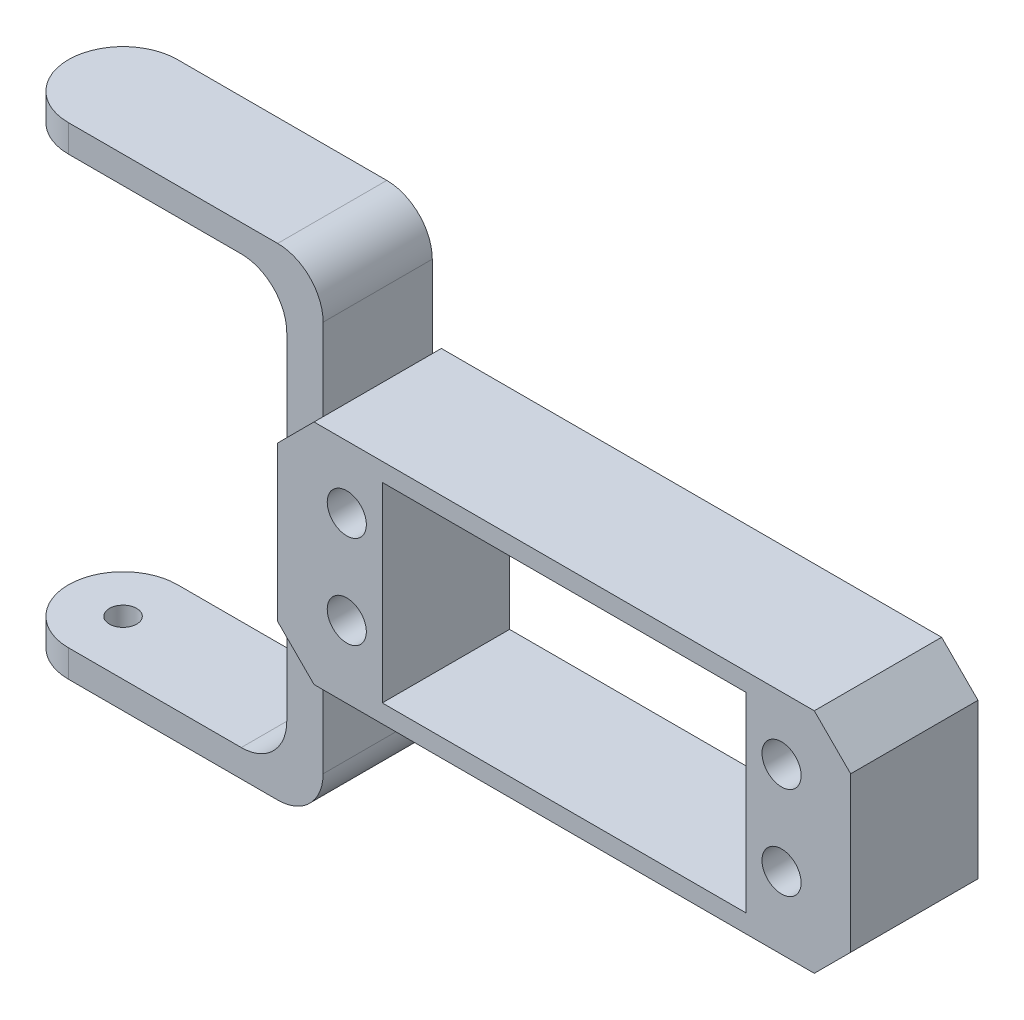
ISO-10303-21;
HEADER;
FILE_DESCRIPTION(('STEP AP214'),'2;1');
FILE_NAME('part.step','',(''),(''),'','','');
FILE_SCHEMA(('AUTOMOTIVE_DESIGN { 1 0 10303 214 1 1 1 1 }'));
ENDSEC;
DATA;
#1=APPLICATION_CONTEXT('core data for automotive mechanical design processes');
#2=APPLICATION_PROTOCOL_DEFINITION('international standard','automotive_design',2000,#1);
#3=PRODUCT_CONTEXT('',#1,'mechanical');
#4=PRODUCT('Part','Part','',(#3));
#5=PRODUCT_RELATED_PRODUCT_CATEGORY('part','',(#4));
#6=PRODUCT_DEFINITION_FORMATION('','',#4);
#7=PRODUCT_DEFINITION_CONTEXT('part definition',#1,'design');
#8=PRODUCT_DEFINITION('design','',#6,#7);
#9=PRODUCT_DEFINITION_SHAPE('','',#8);
#10=(LENGTH_UNIT() NAMED_UNIT(*) SI_UNIT(.MILLI.,.METRE.));
#11=(NAMED_UNIT(*) PLANE_ANGLE_UNIT() SI_UNIT($,.RADIAN.));
#12=(NAMED_UNIT(*) SI_UNIT($,.STERADIAN.) SOLID_ANGLE_UNIT());
#13=UNCERTAINTY_MEASURE_WITH_UNIT(LENGTH_MEASURE(1.E-05),#10,'distance_accuracy_value','');
#14=(GEOMETRIC_REPRESENTATION_CONTEXT(3) GLOBAL_UNCERTAINTY_ASSIGNED_CONTEXT((#13)) GLOBAL_UNIT_ASSIGNED_CONTEXT((#10,
#11,#12)) REPRESENTATION_CONTEXT('',''));
#15=CARTESIAN_POINT('',(0.,0.,0.));
#16=DIRECTION('',(0.,0.,1.));
#17=DIRECTION('',(1.,0.,0.));
#18=AXIS2_PLACEMENT_3D('',#15,#16,#17);
#19=CARTESIAN_POINT('',(-55.5,-26.5,7.));
#20=DIRECTION('',(0.,-1.,0.));
#21=DIRECTION('',(0.,0.,-1.));
#22=AXIS2_PLACEMENT_3D('',#19,#20,#21);
#23=CYLINDRICAL_SURFACE('',#22,6.);
#24=DIRECTION('',(0.,-1.,0.));
#25=VECTOR('',#24,1.);
#26=CARTESIAN_POINT('',(-55.5,-8.48032754033172,1.00000000000001));
#27=LINE('',#26,#25);
#28=CARTESIAN_POINT('',(-55.5,-26.5,1.));
#29=VERTEX_POINT('',#28);
#30=CARTESIAN_POINT('',(-55.5,-23.5,1.));
#31=VERTEX_POINT('',#30);
#32=EDGE_CURVE('E327',#29,#31,#27,.F.);
#33=ORIENTED_EDGE('',*,*,#32,.F.);
#34=CARTESIAN_POINT('',(-55.5,-26.5,7.));
#35=DIRECTION('',(0.,-1.,0.));
#36=DIRECTION('',(0.,0.,-1.));
#37=AXIS2_PLACEMENT_3D('',#34,#35,#36);
#38=CIRCLE('',#37,6.);
#39=CARTESIAN_POINT('',(-55.5,-26.5,13.));
#40=VERTEX_POINT('',#39);
#41=EDGE_CURVE('E47',#40,#29,#38,.T.);
#42=ORIENTED_EDGE('',*,*,#41,.F.);
#43=DIRECTION('',(0.,-1.,0.));
#44=VECTOR('',#43,1.);
#45=CARTESIAN_POINT('',(-55.5,-8.49999999999999,13.));
#46=LINE('',#45,#44);
#47=CARTESIAN_POINT('',(-55.5,-23.5,13.));
#48=VERTEX_POINT('',#47);
#49=EDGE_CURVE('E330',#48,#40,#46,.T.);
#50=ORIENTED_EDGE('',*,*,#49,.F.);
#51=CARTESIAN_POINT('',(-55.5,-23.5,7.));
#52=DIRECTION('',(0.,-1.,0.));
#53=DIRECTION('',(0.,0.,-1.));
#54=AXIS2_PLACEMENT_3D('',#51,#52,#53);
#55=CIRCLE('',#54,6.);
#56=EDGE_CURVE('E11',#31,#48,#55,.F.);
#57=ORIENTED_EDGE('',*,*,#56,.F.);
#58=EDGE_LOOP('',(#33,#42,#50,#57));
#59=FACE_BOUND('',#58,.T.);
#60=ADVANCED_FACE('F39',(#59),#23,.T.);
#61=CARTESIAN_POINT('',(-55.5,23.5,7.));
#62=DIRECTION('',(0.,-1.,0.));
#63=DIRECTION('',(0.,0.,-1.));
#64=AXIS2_PLACEMENT_3D('',#61,#62,#63);
#65=CYLINDRICAL_SURFACE('',#64,5.99999999999999);
#66=DIRECTION('',(0.,-1.,0.));
#67=VECTOR('',#66,1.);
#68=CARTESIAN_POINT('',(-55.5,26.5,1.00000000000001));
#69=LINE('',#68,#67);
#70=CARTESIAN_POINT('',(-55.5,23.5,1.00000000000001));
#71=VERTEX_POINT('',#70);
#72=CARTESIAN_POINT('',(-55.5,26.5,1.00000000000001));
#73=VERTEX_POINT('',#72);
#74=EDGE_CURVE('E317',#71,#73,#69,.F.);
#75=ORIENTED_EDGE('',*,*,#74,.F.);
#76=CARTESIAN_POINT('',(-55.5,23.5,7.));
#77=DIRECTION('',(0.,1.,0.));
#78=DIRECTION('',(0.,0.,1.));
#79=AXIS2_PLACEMENT_3D('',#76,#77,#78);
#80=CIRCLE('',#79,5.99999999999999);
#81=CARTESIAN_POINT('',(-55.5,23.5,13.));
#82=VERTEX_POINT('',#81);
#83=EDGE_CURVE('E323',#82,#71,#80,.F.);
#84=ORIENTED_EDGE('',*,*,#83,.F.);
#85=DIRECTION('',(0.,-1.,0.));
#86=VECTOR('',#85,1.);
#87=CARTESIAN_POINT('',(-55.5,26.5,13.));
#88=LINE('',#87,#86);
#89=CARTESIAN_POINT('',(-55.5,26.5,13.));
#90=VERTEX_POINT('',#89);
#91=EDGE_CURVE('E320',#90,#82,#88,.T.);
#92=ORIENTED_EDGE('',*,*,#91,.F.);
#93=CARTESIAN_POINT('',(-55.5,26.5,7.));
#94=DIRECTION('',(0.,1.,0.));
#95=DIRECTION('',(0.,0.,1.));
#96=AXIS2_PLACEMENT_3D('',#93,#94,#95);
#97=CIRCLE('',#96,5.99999999999999);
#98=EDGE_CURVE('E325',#73,#90,#97,.T.);
#99=ORIENTED_EDGE('',*,*,#98,.F.);
#100=EDGE_LOOP('',(#75,#84,#92,#99));
#101=FACE_BOUND('',#100,.T.);
#102=ADVANCED_FACE('F527',(#101),#65,.T.);
#103=CARTESIAN_POINT('',(-32.5,-21.5,0.));
#104=DIRECTION('',(0.,0.,1.));
#105=DIRECTION('',(1.,0.,0.));
#106=AXIS2_PLACEMENT_3D('',#103,#104,#105);
#107=CYLINDRICAL_SURFACE('',#106,5.);
#108=DIRECTION('',(0.,0.,-1.));
#109=VECTOR('',#108,1.);
#110=CARTESIAN_POINT('',(-27.5,-21.5,0.));
#111=LINE('',#110,#109);
#112=CARTESIAN_POINT('',(-27.5,-21.5,13.));
#113=VERTEX_POINT('',#112);
#114=CARTESIAN_POINT('',(-27.5,-21.5,1.));
#115=VERTEX_POINT('',#114);
#116=EDGE_CURVE('E307',#113,#115,#111,.T.);
#117=ORIENTED_EDGE('',*,*,#116,.F.);
#118=CARTESIAN_POINT('',(-32.5,-21.5,13.));
#119=DIRECTION('',(0.,0.,1.));
#120=DIRECTION('',(0.,-1.,0.));
#121=AXIS2_PLACEMENT_3D('',#118,#119,#120);
#122=CIRCLE('',#121,5.);
#123=CARTESIAN_POINT('',(-32.5,-26.5,13.));
#124=VERTEX_POINT('',#123);
#125=EDGE_CURVE('E313',#124,#113,#122,.T.);
#126=ORIENTED_EDGE('',*,*,#125,.F.);
#127=DIRECTION('',(0.,0.,-1.));
#128=VECTOR('',#127,1.);
#129=CARTESIAN_POINT('',(-32.5,-26.5,0.));
#130=LINE('',#129,#128);
#131=CARTESIAN_POINT('',(-32.5,-26.5,1.));
#132=VERTEX_POINT('',#131);
#133=EDGE_CURVE('E310',#132,#124,#130,.F.);
#134=ORIENTED_EDGE('',*,*,#133,.F.);
#135=CARTESIAN_POINT('',(-32.5,-21.5,1.));
#136=DIRECTION('',(0.,0.,-1.));
#137=DIRECTION('',(0.,1.,0.));
#138=AXIS2_PLACEMENT_3D('',#135,#136,#137);
#139=CIRCLE('',#138,5.);
#140=EDGE_CURVE('E315',#115,#132,#139,.T.);
#141=ORIENTED_EDGE('',*,*,#140,.F.);
#142=EDGE_LOOP('',(#117,#126,#134,#141));
#143=FACE_BOUND('',#142,.T.);
#144=ADVANCED_FACE('F565',(#143),#107,.T.);
#145=CARTESIAN_POINT('',(-36.5,-18.5,14.));
#146=DIRECTION('',(0.,0.,-1.));
#147=DIRECTION('',(0.,1.,0.));
#148=AXIS2_PLACEMENT_3D('',#145,#146,#147);
#149=CYLINDRICAL_SURFACE('',#148,5.);
#150=DIRECTION('',(0.,0.,1.));
#151=VECTOR('',#150,1.);
#152=CARTESIAN_POINT('',(-31.5,-18.5,14.));
#153=LINE('',#152,#151);
#154=CARTESIAN_POINT('',(-31.5,-18.5,1.));
#155=VERTEX_POINT('',#154);
#156=CARTESIAN_POINT('',(-31.5,-18.5,13.));
#157=VERTEX_POINT('',#156);
#158=EDGE_CURVE('E231',#155,#157,#153,.T.);
#159=ORIENTED_EDGE('',*,*,#158,.F.);
#160=CARTESIAN_POINT('',(-36.5,-18.5,1.));
#161=DIRECTION('',(0.,0.,-1.));
#162=DIRECTION('',(0.,1.,0.));
#163=AXIS2_PLACEMENT_3D('',#160,#161,#162);
#164=CIRCLE('',#163,5.);
#165=CARTESIAN_POINT('',(-36.5,-23.5,1.));
#166=VERTEX_POINT('',#165);
#167=EDGE_CURVE('E302',#155,#166,#164,.T.);
#168=ORIENTED_EDGE('',*,*,#167,.T.);
#169=DIRECTION('',(0.,0.,1.));
#170=VECTOR('',#169,1.);
#171=CARTESIAN_POINT('',(-36.5,-23.5,14.));
#172=LINE('',#171,#170);
#173=CARTESIAN_POINT('',(-36.5,-23.5,13.));
#174=VERTEX_POINT('',#173);
#175=EDGE_CURVE('E299',#174,#166,#172,.F.);
#176=ORIENTED_EDGE('',*,*,#175,.F.);
#177=CARTESIAN_POINT('',(-36.5,-18.5,13.));
#178=DIRECTION('',(0.,0.,1.));
#179=DIRECTION('',(0.,-1.,0.));
#180=AXIS2_PLACEMENT_3D('',#177,#178,#179);
#181=CIRCLE('',#180,5.);
#182=EDGE_CURVE('E305',#174,#157,#181,.T.);
#183=ORIENTED_EDGE('',*,*,#182,.T.);
#184=EDGE_LOOP('',(#159,#168,#176,#183));
#185=FACE_BOUND('',#184,.T.);
#186=ADVANCED_FACE('F569',(#185),#149,.F.);
#187=CARTESIAN_POINT('',(-36.5,18.5,14.));
#188=DIRECTION('',(0.,0.,1.));
#189=DIRECTION('',(1.,0.,0.));
#190=AXIS2_PLACEMENT_3D('',#187,#188,#189);
#191=CYLINDRICAL_SURFACE('',#190,5.);
#192=DIRECTION('',(0.,0.,-1.));
#193=VECTOR('',#192,1.);
#194=CARTESIAN_POINT('',(-31.5,18.5,14.));
#195=LINE('',#194,#193);
#196=CARTESIAN_POINT('',(-31.5,18.5,13.));
#197=VERTEX_POINT('',#196);
#198=CARTESIAN_POINT('',(-31.5,18.5,1.00000000000001));
#199=VERTEX_POINT('',#198);
#200=EDGE_CURVE('E287',#197,#199,#195,.T.);
#201=ORIENTED_EDGE('',*,*,#200,.F.);
#202=CARTESIAN_POINT('',(-36.5,18.5,13.));
#203=DIRECTION('',(0.,0.,1.));
#204=DIRECTION('',(0.,-1.,0.));
#205=AXIS2_PLACEMENT_3D('',#202,#203,#204);
#206=CIRCLE('',#205,5.);
#207=CARTESIAN_POINT('',(-36.5,23.5,13.));
#208=VERTEX_POINT('',#207);
#209=EDGE_CURVE('E293',#197,#208,#206,.T.);
#210=ORIENTED_EDGE('',*,*,#209,.T.);
#211=DIRECTION('',(0.,0.,-1.));
#212=VECTOR('',#211,1.);
#213=CARTESIAN_POINT('',(-36.5,23.5,14.));
#214=LINE('',#213,#212);
#215=CARTESIAN_POINT('',(-36.5,23.5,1.00000000000001));
#216=VERTEX_POINT('',#215);
#217=EDGE_CURVE('E290',#216,#208,#214,.F.);
#218=ORIENTED_EDGE('',*,*,#217,.F.);
#219=CARTESIAN_POINT('',(-36.5,18.5,1.00000000000001));
#220=DIRECTION('',(0.,0.,-1.));
#221=DIRECTION('',(0.,1.,0.));
#222=AXIS2_PLACEMENT_3D('',#219,#220,#221);
#223=CIRCLE('',#222,5.);
#224=EDGE_CURVE('E296',#216,#199,#223,.T.);
#225=ORIENTED_EDGE('',*,*,#224,.T.);
#226=EDGE_LOOP('',(#201,#210,#218,#225));
#227=FACE_BOUND('',#226,.T.);
#228=ADVANCED_FACE('F578',(#227),#191,.F.);
#229=CARTESIAN_POINT('',(-32.5,21.5,0.));
#230=DIRECTION('',(0.,0.,1.));
#231=DIRECTION('',(1.,0.,0.));
#232=AXIS2_PLACEMENT_3D('',#229,#230,#231);
#233=CYLINDRICAL_SURFACE('',#232,5.);
#234=DIRECTION('',(0.,0.,1.));
#235=VECTOR('',#234,1.);
#236=CARTESIAN_POINT('',(-27.5,21.5,0.));
#237=LINE('',#236,#235);
#238=CARTESIAN_POINT('',(-27.5,21.5,1.00000000000001));
#239=VERTEX_POINT('',#238);
#240=CARTESIAN_POINT('',(-27.5,21.5,13.));
#241=VERTEX_POINT('',#240);
#242=EDGE_CURVE('E247',#239,#241,#237,.T.);
#243=ORIENTED_EDGE('',*,*,#242,.F.);
#244=CARTESIAN_POINT('',(-32.5,21.5,1.00000000000001));
#245=DIRECTION('',(0.,0.,-1.));
#246=DIRECTION('',(0.,1.,0.));
#247=AXIS2_PLACEMENT_3D('',#244,#245,#246);
#248=CIRCLE('',#247,5.);
#249=CARTESIAN_POINT('',(-32.5,26.5,1.00000000000001));
#250=VERTEX_POINT('',#249);
#251=EDGE_CURVE('E283',#250,#239,#248,.T.);
#252=ORIENTED_EDGE('',*,*,#251,.F.);
#253=DIRECTION('',(0.,0.,1.));
#254=VECTOR('',#253,1.);
#255=CARTESIAN_POINT('',(-32.5,26.5,1.00000000000001));
#256=LINE('',#255,#254);
#257=CARTESIAN_POINT('',(-32.5,26.5,13.));
#258=VERTEX_POINT('',#257);
#259=EDGE_CURVE('E280',#258,#250,#256,.F.);
#260=ORIENTED_EDGE('',*,*,#259,.F.);
#261=CARTESIAN_POINT('',(-32.5,21.5,13.));
#262=DIRECTION('',(0.,0.,1.));
#263=DIRECTION('',(0.,-1.,0.));
#264=AXIS2_PLACEMENT_3D('',#261,#262,#263);
#265=CIRCLE('',#264,5.);
#266=EDGE_CURVE('E285',#241,#258,#265,.T.);
#267=ORIENTED_EDGE('',*,*,#266,.F.);
#268=EDGE_LOOP('',(#243,#252,#260,#267));
#269=FACE_BOUND('',#268,.T.);
#270=ADVANCED_FACE('F519',(#269),#233,.T.);
#271=CARTESIAN_POINT('',(-31.5,8.5,14.));
#272=DIRECTION('',(1.,0.,0.));
#273=DIRECTION('',(0.,0.,-1.));
#274=AXIS2_PLACEMENT_3D('',#271,#272,#273);
#275=PLANE('',#274);
#276=DIRECTION('',(0.,-1.,0.));
#277=VECTOR('',#276,1.);
#278=CARTESIAN_POINT('',(-31.5,-8.48032754033172,1.00000000000001));
#279=LINE('',#278,#277);
#280=CARTESIAN_POINT('',(-31.5,-8.49999999999999,1.00000000000001));
#281=VERTEX_POINT('',#280);
#282=EDGE_CURVE('E234',#281,#155,#279,.T.);
#283=ORIENTED_EDGE('',*,*,#282,.T.);
#284=ORIENTED_EDGE('',*,*,#158,.T.);
#285=DIRECTION('',(0.,1.,0.));
#286=VECTOR('',#285,1.);
#287=CARTESIAN_POINT('',(-31.5,-8.49999999999999,13.));
#288=LINE('',#287,#286);
#289=CARTESIAN_POINT('',(-31.5,-8.49999999999999,13.));
#290=VERTEX_POINT('',#289);
#291=EDGE_CURVE('E222',#157,#290,#288,.T.);
#292=ORIENTED_EDGE('',*,*,#291,.T.);
#293=DIRECTION('',(0.,0.,-1.));
#294=VECTOR('',#293,1.);
#295=CARTESIAN_POINT('',(-31.5,-8.49999999999999,14.));
#296=LINE('',#295,#294);
#297=CARTESIAN_POINT('',(-31.5,-8.49999999999999,14.));
#298=VERTEX_POINT('',#297);
#299=EDGE_CURVE('E228',#298,#290,#296,.T.);
#300=ORIENTED_EDGE('',*,*,#299,.F.);
#301=DIRECTION('',(0.,-1.,0.));
#302=VECTOR('',#301,1.);
#303=CARTESIAN_POINT('',(-31.5,8.5,14.));
#304=LINE('',#303,#302);
#305=CARTESIAN_POINT('',(-31.5,8.5,14.));
#306=VERTEX_POINT('',#305);
#307=EDGE_CURVE('E429',#306,#298,#304,.T.);
#308=ORIENTED_EDGE('',*,*,#307,.F.);
#309=DIRECTION('',(0.,0.,-1.));
#310=VECTOR('',#309,1.);
#311=CARTESIAN_POINT('',(-31.5,8.5,14.));
#312=LINE('',#311,#310);
#313=CARTESIAN_POINT('',(-31.5,8.5,13.));
#314=VERTEX_POINT('',#313);
#315=EDGE_CURVE('E255',#306,#314,#312,.T.);
#316=ORIENTED_EDGE('',*,*,#315,.T.);
#317=DIRECTION('',(0.,1.,0.));
#318=VECTOR('',#317,1.);
#319=CARTESIAN_POINT('',(-31.5,26.5,13.));
#320=LINE('',#319,#318);
#321=EDGE_CURVE('E353',#314,#197,#320,.T.);
#322=ORIENTED_EDGE('',*,*,#321,.T.);
#323=ORIENTED_EDGE('',*,*,#200,.T.);
#324=DIRECTION('',(0.,-1.,0.));
#325=VECTOR('',#324,1.);
#326=CARTESIAN_POINT('',(-31.5,26.5,1.00000000000001));
#327=LINE('',#326,#325);
#328=CARTESIAN_POINT('',(-31.5,8.5,1.00000000000001));
#329=VERTEX_POINT('',#328);
#330=EDGE_CURVE('E345',#199,#329,#327,.T.);
#331=ORIENTED_EDGE('',*,*,#330,.T.);
#332=CARTESIAN_POINT('',(-31.5,8.5,0.));
#333=VERTEX_POINT('',#332);
#334=EDGE_CURVE('E252',#329,#333,#312,.T.);
#335=ORIENTED_EDGE('',*,*,#334,.T.);
#336=DIRECTION('',(0.,-1.,0.));
#337=VECTOR('',#336,1.);
#338=CARTESIAN_POINT('',(-31.5,8.5,0.));
#339=LINE('',#338,#337);
#340=CARTESIAN_POINT('',(-31.5,-8.49999999999999,0.));
#341=VERTEX_POINT('',#340);
#342=EDGE_CURVE('E447',#333,#341,#339,.T.);
#343=ORIENTED_EDGE('',*,*,#342,.T.);
#344=EDGE_CURVE('E253',#281,#341,#296,.T.);
#345=ORIENTED_EDGE('',*,*,#344,.F.);
#346=EDGE_LOOP('',(#283,#284,#292,#300,#308,#316,#322,#323,#331,#335,#343,#345));
#347=FACE_BOUND('',#346,.T.);
#348=ADVANCED_FACE('F225',(#347),#275,.F.);
#349=CARTESIAN_POINT('',(-27.5,-12.5,14.));
#350=DIRECTION('',(0.707106781186547,0.707106781186548,0.));
#351=DIRECTION('',(-0.707106781186548,0.707106781186547,0.));
#352=AXIS2_PLACEMENT_3D('',#349,#350,#351);
#353=PLANE('',#352);
#354=ORIENTED_EDGE('',*,*,#299,.T.);
#355=DIRECTION('',(0.707106781186548,-0.707106781186547,0.));
#356=VECTOR('',#355,1.);
#357=CARTESIAN_POINT('',(-27.5,-12.5,13.));
#358=LINE('',#357,#356);
#359=CARTESIAN_POINT('',(-27.5,-12.5,13.));
#360=VERTEX_POINT('',#359);
#361=EDGE_CURVE('E238',#290,#360,#358,.T.);
#362=ORIENTED_EDGE('',*,*,#361,.T.);
#363=DIRECTION('',(0.,0.,-1.));
#364=VECTOR('',#363,1.);
#365=CARTESIAN_POINT('',(-27.5,-12.5,14.));
#366=LINE('',#365,#364);
#367=CARTESIAN_POINT('',(-27.5,-12.5,14.));
#368=VERTEX_POINT('',#367);
#369=EDGE_CURVE('E257',#368,#360,#366,.T.);
#370=ORIENTED_EDGE('',*,*,#369,.F.);
#371=DIRECTION('',(0.707106781186548,-0.707106781186547,0.));
#372=VECTOR('',#371,1.);
#373=CARTESIAN_POINT('',(-27.5,-12.5,14.));
#374=LINE('',#373,#372);
#375=EDGE_CURVE('E251',#298,#368,#374,.T.);
#376=ORIENTED_EDGE('',*,*,#375,.F.);
#377=EDGE_LOOP('',(#354,#362,#370,#376));
#378=FACE_BOUND('',#377,.T.);
#379=ADVANCED_FACE('F250',(#378),#353,.F.);
#380=CARTESIAN_POINT('',(-27.5,12.5,14.));
#381=DIRECTION('',(0.707106781186547,-0.707106781186548,0.));
#382=DIRECTION('',(0.707106781186548,0.707106781186547,0.));
#383=AXIS2_PLACEMENT_3D('',#380,#381,#382);
#384=PLANE('',#383);
#385=DIRECTION('',(0.,0.,-1.));
#386=VECTOR('',#385,1.);
#387=CARTESIAN_POINT('',(-27.5,12.5,14.));
#388=LINE('',#387,#386);
#389=CARTESIAN_POINT('',(-27.5,12.5,14.));
#390=VERTEX_POINT('',#389);
#391=CARTESIAN_POINT('',(-27.5,12.5,13.));
#392=VERTEX_POINT('',#391);
#393=EDGE_CURVE('E263',#390,#392,#388,.T.);
#394=ORIENTED_EDGE('',*,*,#393,.T.);
#395=DIRECTION('',(-0.707106781186548,-0.707106781186547,0.));
#396=VECTOR('',#395,1.);
#397=CARTESIAN_POINT('',(-27.5,12.5,13.));
#398=LINE('',#397,#396);
#399=EDGE_CURVE('E273',#392,#314,#398,.T.);
#400=ORIENTED_EDGE('',*,*,#399,.T.);
#401=ORIENTED_EDGE('',*,*,#315,.F.);
#402=DIRECTION('',(-0.707106781186548,-0.707106781186547,0.));
#403=VECTOR('',#402,1.);
#404=CARTESIAN_POINT('',(-27.5,12.5,14.));
#405=LINE('',#404,#403);
#406=EDGE_CURVE('E427',#390,#306,#405,.T.);
#407=ORIENTED_EDGE('',*,*,#406,.F.);
#408=EDGE_LOOP('',(#394,#400,#401,#407));
#409=FACE_BOUND('',#408,.T.);
#410=ADVANCED_FACE('F482',(#409),#384,.F.);
#411=CARTESIAN_POINT('',(0.,0.,14.));
#412=DIRECTION('',(0.,0.,1.));
#413=DIRECTION('',(1.,0.,0.));
#414=AXIS2_PLACEMENT_3D('',#411,#412,#413);
#415=PLANE('',#414);
#416=CARTESIAN_POINT('',(23.9,-4.60000000000001,14.));
#417=DIRECTION('',(0.,0.,-1.));
#418=DIRECTION('',(-1.,0.,0.));
#419=AXIS2_PLACEMENT_3D('',#416,#417,#418);
#420=CIRCLE('',#419,2.15);
#421=CARTESIAN_POINT('',(21.75,-4.60000000000001,14.));
#422=VERTEX_POINT('',#421);
#423=EDGE_CURVE('E372',#422,#422,#420,.T.);
#424=ORIENTED_EDGE('',*,*,#423,.T.);
#425=EDGE_LOOP('',(#424));
#426=FACE_BOUND('',#425,.T.);
#427=CARTESIAN_POINT('',(-23.8999999999999,5.59999999999998,14.));
#428=DIRECTION('',(0.,0.,-1.));
#429=DIRECTION('',(-1.,0.,0.));
#430=AXIS2_PLACEMENT_3D('',#427,#428,#429);
#431=CIRCLE('',#430,2.15);
#432=CARTESIAN_POINT('',(-26.0499999999999,5.59999999999998,14.));
#433=VERTEX_POINT('',#432);
#434=EDGE_CURVE('E379',#433,#433,#431,.T.);
#435=ORIENTED_EDGE('',*,*,#434,.T.);
#436=EDGE_LOOP('',(#435));
#437=FACE_BOUND('',#436,.T.);
#438=CARTESIAN_POINT('',(-23.8999999999999,-4.60000000000001,14.));
#439=DIRECTION('',(0.,0.,-1.));
#440=DIRECTION('',(-1.,0.,0.));
#441=AXIS2_PLACEMENT_3D('',#438,#439,#440);
#442=CIRCLE('',#441,2.15);
#443=CARTESIAN_POINT('',(-26.05,-4.60000000000001,14.));
#444=VERTEX_POINT('',#443);
#445=EDGE_CURVE('E366',#444,#444,#442,.T.);
#446=ORIENTED_EDGE('',*,*,#445,.T.);
#447=EDGE_LOOP('',(#446));
#448=FACE_BOUND('',#447,.T.);
#449=CARTESIAN_POINT('',(23.9,5.59999999999999,14.));
#450=DIRECTION('',(0.,0.,-1.));
#451=DIRECTION('',(-1.,0.,0.));
#452=AXIS2_PLACEMENT_3D('',#449,#450,#451);
#453=CIRCLE('',#452,2.15);
#454=CARTESIAN_POINT('',(21.75,5.59999999999999,14.));
#455=VERTEX_POINT('',#454);
#456=EDGE_CURVE('E384',#455,#455,#453,.T.);
#457=ORIENTED_EDGE('',*,*,#456,.T.);
#458=EDGE_LOOP('',(#457));
#459=FACE_BOUND('',#458,.T.);
#460=DIRECTION('',(-0.707106781186548,0.707106781186547,0.));
#461=VECTOR('',#460,1.);
#462=CARTESIAN_POINT('',(27.5,12.5,14.));
#463=LINE('',#462,#461);
#464=CARTESIAN_POINT('',(31.5,8.5,14.));
#465=VERTEX_POINT('',#464);
#466=CARTESIAN_POINT('',(27.5,12.5,14.));
#467=VERTEX_POINT('',#466);
#468=EDGE_CURVE('E421',#465,#467,#463,.T.);
#469=ORIENTED_EDGE('',*,*,#468,.T.);
#470=DIRECTION('',(-1.,0.,0.));
#471=VECTOR('',#470,1.);
#472=CARTESIAN_POINT('',(-27.5,12.5,14.));
#473=LINE('',#472,#471);
#474=EDGE_CURVE('E424',#467,#390,#473,.T.);
#475=ORIENTED_EDGE('',*,*,#474,.T.);
#476=ORIENTED_EDGE('',*,*,#406,.T.);
#477=ORIENTED_EDGE('',*,*,#307,.T.);
#478=ORIENTED_EDGE('',*,*,#375,.T.);
#479=DIRECTION('',(1.,0.,0.));
#480=VECTOR('',#479,1.);
#481=CARTESIAN_POINT('',(-27.5,-12.5,14.));
#482=LINE('',#481,#480);
#483=CARTESIAN_POINT('',(27.5,-12.5,14.));
#484=VERTEX_POINT('',#483);
#485=EDGE_CURVE('E432',#368,#484,#482,.T.);
#486=ORIENTED_EDGE('',*,*,#485,.T.);
#487=DIRECTION('',(0.707106781186548,0.707106781186547,0.));
#488=VECTOR('',#487,1.);
#489=CARTESIAN_POINT('',(27.5,-12.5,14.));
#490=LINE('',#489,#488);
#491=CARTESIAN_POINT('',(31.5,-8.49999999999999,14.));
#492=VERTEX_POINT('',#491);
#493=EDGE_CURVE('E434',#484,#492,#490,.T.);
#494=ORIENTED_EDGE('',*,*,#493,.T.);
#495=DIRECTION('',(0.,1.,0.));
#496=VECTOR('',#495,1.);
#497=CARTESIAN_POINT('',(31.5,8.5,14.));
#498=LINE('',#497,#496);
#499=EDGE_CURVE('E436',#492,#465,#498,.T.);
#500=ORIENTED_EDGE('',*,*,#499,.T.);
#501=EDGE_LOOP('',(#469,#475,#476,#477,#478,#486,#494,#500));
#502=FACE_BOUND('',#501,.T.);
#503=DIRECTION('',(-1.,0.,0.));
#504=VECTOR('',#503,1.);
#505=CARTESIAN_POINT('',(-20.,10.5,14.));
#506=LINE('',#505,#504);
#507=CARTESIAN_POINT('',(20.,10.5,14.));
#508=VERTEX_POINT('',#507);
#509=CARTESIAN_POINT('',(-20.,10.5,14.));
#510=VERTEX_POINT('',#509);
#511=EDGE_CURVE('E392',#508,#510,#506,.T.);
#512=ORIENTED_EDGE('',*,*,#511,.F.);
#513=DIRECTION('',(0.,1.,0.));
#514=VECTOR('',#513,1.);
#515=CARTESIAN_POINT('',(20.,10.5,14.));
#516=LINE('',#515,#514);
#517=CARTESIAN_POINT('',(20.,-10.5,14.));
#518=VERTEX_POINT('',#517);
#519=EDGE_CURVE('E390',#518,#508,#516,.T.);
#520=ORIENTED_EDGE('',*,*,#519,.F.);
#521=DIRECTION('',(1.,0.,0.));
#522=VECTOR('',#521,1.);
#523=CARTESIAN_POINT('',(-20.,-10.5,14.));
#524=LINE('',#523,#522);
#525=CARTESIAN_POINT('',(-20.,-10.5,14.));
#526=VERTEX_POINT('',#525);
#527=EDGE_CURVE('E398',#526,#518,#524,.T.);
#528=ORIENTED_EDGE('',*,*,#527,.F.);
#529=DIRECTION('',(0.,-1.,0.));
#530=VECTOR('',#529,1.);
#531=CARTESIAN_POINT('',(-20.,10.5,14.));
#532=LINE('',#531,#530);
#533=EDGE_CURVE('E395',#510,#526,#532,.T.);
#534=ORIENTED_EDGE('',*,*,#533,.F.);
#535=EDGE_LOOP('',(#512,#520,#528,#534));
#536=FACE_BOUND('',#535,.T.);
#537=ADVANCED_FACE('F476',(#426,#437,#448,#459,#502,#536),#415,.T.);
#538=CARTESIAN_POINT('',(0.,0.,0.));
#539=DIRECTION('',(0.,0.,1.));
#540=DIRECTION('',(1.,0.,0.));
#541=AXIS2_PLACEMENT_3D('',#538,#539,#540);
#542=PLANE('',#541);
#543=CARTESIAN_POINT('',(23.9,-4.60000000000001,0.));
#544=DIRECTION('',(0.,0.,-1.));
#545=DIRECTION('',(-1.,0.,0.));
#546=AXIS2_PLACEMENT_3D('',#543,#544,#545);
#547=CIRCLE('',#546,2.15);
#548=CARTESIAN_POINT('',(21.75,-4.60000000000001,0.));
#549=VERTEX_POINT('',#548);
#550=EDGE_CURVE('E376',#549,#549,#547,.T.);
#551=ORIENTED_EDGE('',*,*,#550,.F.);
#552=EDGE_LOOP('',(#551));
#553=FACE_BOUND('',#552,.T.);
#554=CARTESIAN_POINT('',(-23.8999999999999,5.59999999999998,0.));
#555=DIRECTION('',(0.,0.,-1.));
#556=DIRECTION('',(-1.,0.,0.));
#557=AXIS2_PLACEMENT_3D('',#554,#555,#556);
#558=CIRCLE('',#557,2.15);
#559=CARTESIAN_POINT('',(-26.0499999999999,5.59999999999998,0.));
#560=VERTEX_POINT('',#559);
#561=EDGE_CURVE('E369',#560,#560,#558,.T.);
#562=ORIENTED_EDGE('',*,*,#561,.F.);
#563=EDGE_LOOP('',(#562));
#564=FACE_BOUND('',#563,.T.);
#565=CARTESIAN_POINT('',(-23.8999999999999,-4.60000000000001,0.));
#566=DIRECTION('',(0.,0.,-1.));
#567=DIRECTION('',(-1.,0.,0.));
#568=AXIS2_PLACEMENT_3D('',#565,#566,#567);
#569=CIRCLE('',#568,2.15);
#570=CARTESIAN_POINT('',(-26.05,-4.60000000000001,0.));
#571=VERTEX_POINT('',#570);
#572=EDGE_CURVE('E363',#571,#571,#569,.T.);
#573=ORIENTED_EDGE('',*,*,#572,.F.);
#574=EDGE_LOOP('',(#573));
#575=FACE_BOUND('',#574,.T.);
#576=CARTESIAN_POINT('',(23.9,5.59999999999999,0.));
#577=DIRECTION('',(0.,0.,-1.));
#578=DIRECTION('',(-1.,0.,0.));
#579=AXIS2_PLACEMENT_3D('',#576,#577,#578);
#580=CIRCLE('',#579,2.15);
#581=CARTESIAN_POINT('',(21.75,5.59999999999999,0.));
#582=VERTEX_POINT('',#581);
#583=EDGE_CURVE('E375',#582,#582,#580,.T.);
#584=ORIENTED_EDGE('',*,*,#583,.F.);
#585=EDGE_LOOP('',(#584));
#586=FACE_BOUND('',#585,.T.);
#587=DIRECTION('',(-0.707106781186548,0.707106781186547,0.));
#588=VECTOR('',#587,1.);
#589=CARTESIAN_POINT('',(27.5,12.5,0.));
#590=LINE('',#589,#588);
#591=CARTESIAN_POINT('',(31.5,8.5,0.));
#592=VERTEX_POINT('',#591);
#593=CARTESIAN_POINT('',(27.5,12.5,0.));
#594=VERTEX_POINT('',#593);
#595=EDGE_CURVE('E420',#592,#594,#590,.T.);
#596=ORIENTED_EDGE('',*,*,#595,.F.);
#597=DIRECTION('',(0.,1.,0.));
#598=VECTOR('',#597,1.);
#599=CARTESIAN_POINT('',(31.5,8.5,0.));
#600=LINE('',#599,#598);
#601=CARTESIAN_POINT('',(31.5,-8.49999999999999,0.));
#602=VERTEX_POINT('',#601);
#603=EDGE_CURVE('E425',#602,#592,#600,.T.);
#604=ORIENTED_EDGE('',*,*,#603,.F.);
#605=DIRECTION('',(0.707106781186548,0.707106781186547,0.));
#606=VECTOR('',#605,1.);
#607=CARTESIAN_POINT('',(27.5,-12.5,0.));
#608=LINE('',#607,#606);
#609=CARTESIAN_POINT('',(27.5,-12.5,0.));
#610=VERTEX_POINT('',#609);
#611=EDGE_CURVE('E455',#610,#602,#608,.T.);
#612=ORIENTED_EDGE('',*,*,#611,.F.);
#613=DIRECTION('',(1.,0.,0.));
#614=VECTOR('',#613,1.);
#615=CARTESIAN_POINT('',(-27.5,-12.5,0.));
#616=LINE('',#615,#614);
#617=CARTESIAN_POINT('',(-27.5,-12.5,0.));
#618=VERTEX_POINT('',#617);
#619=EDGE_CURVE('E453',#618,#610,#616,.T.);
#620=ORIENTED_EDGE('',*,*,#619,.F.);
#621=DIRECTION('',(0.707106781186548,-0.707106781186547,0.));
#622=VECTOR('',#621,1.);
#623=CARTESIAN_POINT('',(-27.5,-12.5,0.));
#624=LINE('',#623,#622);
#625=EDGE_CURVE('E450',#341,#618,#624,.T.);
#626=ORIENTED_EDGE('',*,*,#625,.F.);
#627=ORIENTED_EDGE('',*,*,#342,.F.);
#628=DIRECTION('',(-0.707106781186548,-0.707106781186547,0.));
#629=VECTOR('',#628,1.);
#630=CARTESIAN_POINT('',(-27.5,12.5,0.));
#631=LINE('',#630,#629);
#632=CARTESIAN_POINT('',(-27.5,12.5,0.));
#633=VERTEX_POINT('',#632);
#634=EDGE_CURVE('E444',#633,#333,#631,.T.);
#635=ORIENTED_EDGE('',*,*,#634,.F.);
#636=DIRECTION('',(-1.,0.,0.));
#637=VECTOR('',#636,1.);
#638=CARTESIAN_POINT('',(-27.5,12.5,0.));
#639=LINE('',#638,#637);
#640=EDGE_CURVE('E441',#594,#633,#639,.T.);
#641=ORIENTED_EDGE('',*,*,#640,.F.);
#642=EDGE_LOOP('',(#596,#604,#612,#620,#626,#627,#635,#641));
#643=FACE_BOUND('',#642,.T.);
#644=DIRECTION('',(0.,1.,0.));
#645=VECTOR('',#644,1.);
#646=CARTESIAN_POINT('',(20.,10.5,0.));
#647=LINE('',#646,#645);
#648=CARTESIAN_POINT('',(20.,-10.5,0.));
#649=VERTEX_POINT('',#648);
#650=CARTESIAN_POINT('',(20.,10.5,0.));
#651=VERTEX_POINT('',#650);
#652=EDGE_CURVE('E387',#649,#651,#647,.T.);
#653=ORIENTED_EDGE('',*,*,#652,.T.);
#654=DIRECTION('',(-1.,0.,0.));
#655=VECTOR('',#654,1.);
#656=CARTESIAN_POINT('',(-20.,10.5,0.));
#657=LINE('',#656,#655);
#658=CARTESIAN_POINT('',(-20.,10.5,0.));
#659=VERTEX_POINT('',#658);
#660=EDGE_CURVE('E403',#651,#659,#657,.T.);
#661=ORIENTED_EDGE('',*,*,#660,.T.);
#662=DIRECTION('',(0.,-1.,0.));
#663=VECTOR('',#662,1.);
#664=CARTESIAN_POINT('',(-20.,10.5,0.));
#665=LINE('',#664,#663);
#666=CARTESIAN_POINT('',(-20.,-10.5,0.));
#667=VERTEX_POINT('',#666);
#668=EDGE_CURVE('E406',#659,#667,#665,.T.);
#669=ORIENTED_EDGE('',*,*,#668,.T.);
#670=DIRECTION('',(1.,0.,0.));
#671=VECTOR('',#670,1.);
#672=CARTESIAN_POINT('',(-20.,-10.5,0.));
#673=LINE('',#672,#671);
#674=EDGE_CURVE('E393',#667,#649,#673,.T.);
#675=ORIENTED_EDGE('',*,*,#674,.T.);
#676=EDGE_LOOP('',(#653,#661,#669,#675));
#677=FACE_BOUND('',#676,.T.);
#678=ADVANCED_FACE('F505',(#553,#564,#575,#586,#643,#677),#542,.F.);
#679=CARTESIAN_POINT('',(27.5,12.5,14.));
#680=DIRECTION('',(-0.707106781186547,-0.707106781186548,0.));
#681=DIRECTION('',(0.707106781186548,-0.707106781186547,0.));
#682=AXIS2_PLACEMENT_3D('',#679,#680,#681);
#683=PLANE('',#682);
#684=ORIENTED_EDGE('',*,*,#595,.T.);
#685=DIRECTION('',(0.,0.,-1.));
#686=VECTOR('',#685,1.);
#687=CARTESIAN_POINT('',(27.5,12.5,14.));
#688=LINE('',#687,#686);
#689=EDGE_CURVE('E266',#467,#594,#688,.T.);
#690=ORIENTED_EDGE('',*,*,#689,.F.);
#691=ORIENTED_EDGE('',*,*,#468,.F.);
#692=DIRECTION('',(0.,0.,-1.));
#693=VECTOR('',#692,1.);
#694=CARTESIAN_POINT('',(31.5,8.5,14.));
#695=LINE('',#694,#693);
#696=EDGE_CURVE('E438',#465,#592,#695,.T.);
#697=ORIENTED_EDGE('',*,*,#696,.T.);
#698=EDGE_LOOP('',(#684,#690,#691,#697));
#699=FACE_BOUND('',#698,.T.);
#700=ADVANCED_FACE('F550',(#699),#683,.F.);
#701=CARTESIAN_POINT('',(-27.5,12.5,14.));
#702=DIRECTION('',(0.,-1.,0.));
#703=DIRECTION('',(0.,0.,-1.));
#704=AXIS2_PLACEMENT_3D('',#701,#702,#703);
#705=PLANE('',#704);
#706=ORIENTED_EDGE('',*,*,#640,.T.);
#707=CARTESIAN_POINT('',(-27.5,12.5,1.00000000000001));
#708=VERTEX_POINT('',#707);
#709=EDGE_CURVE('E262',#708,#633,#388,.T.);
#710=ORIENTED_EDGE('',*,*,#709,.F.);
#711=EDGE_CURVE('E267',#392,#708,#388,.T.);
#712=ORIENTED_EDGE('',*,*,#711,.F.);
#713=ORIENTED_EDGE('',*,*,#393,.F.);
#714=ORIENTED_EDGE('',*,*,#474,.F.);
#715=ORIENTED_EDGE('',*,*,#689,.T.);
#716=EDGE_LOOP('',(#706,#710,#712,#713,#714,#715));
#717=FACE_BOUND('',#716,.T.);
#718=ADVANCED_FACE('F495',(#717),#705,.F.);
#719=ORIENTED_EDGE('',*,*,#334,.F.);
#720=DIRECTION('',(0.707106781186548,0.707106781186547,0.));
#721=VECTOR('',#720,1.);
#722=CARTESIAN_POINT('',(-27.5,12.5,1.00000000000001));
#723=LINE('',#722,#721);
#724=EDGE_CURVE('E270',#329,#708,#723,.T.);
#725=ORIENTED_EDGE('',*,*,#724,.T.);
#726=ORIENTED_EDGE('',*,*,#709,.T.);
#727=ORIENTED_EDGE('',*,*,#634,.T.);
#728=EDGE_LOOP('',(#719,#725,#726,#727));
#729=FACE_BOUND('',#728,.T.);
#730=ADVANCED_FACE('F498',(#729),#384,.F.);
#731=CARTESIAN_POINT('',(-27.5,-12.5,1.));
#732=VERTEX_POINT('',#731);
#733=EDGE_CURVE('E464',#732,#618,#366,.T.);
#734=ORIENTED_EDGE('',*,*,#733,.F.);
#735=DIRECTION('',(-0.707106781186548,0.707106781186547,0.));
#736=VECTOR('',#735,1.);
#737=CARTESIAN_POINT('',(-27.5,-12.5,1.));
#738=LINE('',#737,#736);
#739=EDGE_CURVE('E248',#732,#281,#738,.T.);
#740=ORIENTED_EDGE('',*,*,#739,.T.);
#741=ORIENTED_EDGE('',*,*,#344,.T.);
#742=ORIENTED_EDGE('',*,*,#625,.T.);
#743=EDGE_LOOP('',(#734,#740,#741,#742));
#744=FACE_BOUND('',#743,.T.);
#745=ADVANCED_FACE('F541',(#744),#353,.F.);
#746=CARTESIAN_POINT('',(-27.5,-12.5,14.));
#747=DIRECTION('',(0.,1.,0.));
#748=DIRECTION('',(0.,0.,1.));
#749=AXIS2_PLACEMENT_3D('',#746,#747,#748);
#750=PLANE('',#749);
#751=ORIENTED_EDGE('',*,*,#619,.T.);
#752=DIRECTION('',(0.,0.,-1.));
#753=VECTOR('',#752,1.);
#754=CARTESIAN_POINT('',(27.5,-12.5,14.));
#755=LINE('',#754,#753);
#756=EDGE_CURVE('E462',#484,#610,#755,.T.);
#757=ORIENTED_EDGE('',*,*,#756,.F.);
#758=ORIENTED_EDGE('',*,*,#485,.F.);
#759=ORIENTED_EDGE('',*,*,#369,.T.);
#760=EDGE_CURVE('E469',#360,#732,#366,.T.);
#761=ORIENTED_EDGE('',*,*,#760,.T.);
#762=ORIENTED_EDGE('',*,*,#733,.T.);
#763=EDGE_LOOP('',(#751,#757,#758,#759,#761,#762));
#764=FACE_BOUND('',#763,.T.);
#765=ADVANCED_FACE('F474',(#764),#750,.F.);
#766=CARTESIAN_POINT('',(27.5,-12.5,14.));
#767=DIRECTION('',(-0.707106781186547,0.707106781186548,0.));
#768=DIRECTION('',(-0.707106781186548,-0.707106781186547,0.));
#769=AXIS2_PLACEMENT_3D('',#766,#767,#768);
#770=PLANE('',#769);
#771=ORIENTED_EDGE('',*,*,#611,.T.);
#772=DIRECTION('',(0.,0.,-1.));
#773=VECTOR('',#772,1.);
#774=CARTESIAN_POINT('',(31.5,-8.49999999999999,14.));
#775=LINE('',#774,#773);
#776=EDGE_CURVE('E460',#492,#602,#775,.T.);
#777=ORIENTED_EDGE('',*,*,#776,.F.);
#778=ORIENTED_EDGE('',*,*,#493,.F.);
#779=ORIENTED_EDGE('',*,*,#756,.T.);
#780=EDGE_LOOP('',(#771,#777,#778,#779));
#781=FACE_BOUND('',#780,.T.);
#782=ADVANCED_FACE('F543',(#781),#770,.F.);
#783=CARTESIAN_POINT('',(31.5,8.5,14.));
#784=DIRECTION('',(-1.,0.,0.));
#785=DIRECTION('',(0.,0.,1.));
#786=AXIS2_PLACEMENT_3D('',#783,#784,#785);
#787=PLANE('',#786);
#788=ORIENTED_EDGE('',*,*,#603,.T.);
#789=ORIENTED_EDGE('',*,*,#696,.F.);
#790=ORIENTED_EDGE('',*,*,#499,.F.);
#791=ORIENTED_EDGE('',*,*,#776,.T.);
#792=EDGE_LOOP('',(#788,#789,#790,#791));
#793=FACE_BOUND('',#792,.T.);
#794=ADVANCED_FACE('F546',(#793),#787,.F.);
#795=CARTESIAN_POINT('',(20.,10.5,14.));
#796=DIRECTION('',(-1.,0.,0.));
#797=DIRECTION('',(0.,0.,1.));
#798=AXIS2_PLACEMENT_3D('',#795,#796,#797);
#799=PLANE('',#798);
#800=ORIENTED_EDGE('',*,*,#652,.F.);
#801=DIRECTION('',(0.,0.,-1.));
#802=VECTOR('',#801,1.);
#803=CARTESIAN_POINT('',(20.,-10.5,14.));
#804=LINE('',#803,#802);
#805=EDGE_CURVE('E400',#518,#649,#804,.T.);
#806=ORIENTED_EDGE('',*,*,#805,.F.);
#807=ORIENTED_EDGE('',*,*,#519,.T.);
#808=DIRECTION('',(0.,0.,-1.));
#809=VECTOR('',#808,1.);
#810=CARTESIAN_POINT('',(20.,10.5,14.));
#811=LINE('',#810,#809);
#812=EDGE_CURVE('E417',#508,#651,#811,.T.);
#813=ORIENTED_EDGE('',*,*,#812,.T.);
#814=EDGE_LOOP('',(#800,#806,#807,#813));
#815=FACE_BOUND('',#814,.T.);
#816=ADVANCED_FACE('F607',(#815),#799,.T.);
#817=CARTESIAN_POINT('',(-20.,10.5,14.));
#818=DIRECTION('',(0.,-1.,0.));
#819=DIRECTION('',(0.,0.,-1.));
#820=AXIS2_PLACEMENT_3D('',#817,#818,#819);
#821=PLANE('',#820);
#822=ORIENTED_EDGE('',*,*,#660,.F.);
#823=ORIENTED_EDGE('',*,*,#812,.F.);
#824=ORIENTED_EDGE('',*,*,#511,.T.);
#825=DIRECTION('',(0.,0.,-1.));
#826=VECTOR('',#825,1.);
#827=CARTESIAN_POINT('',(-20.,10.5,14.));
#828=LINE('',#827,#826);
#829=EDGE_CURVE('E415',#510,#659,#828,.T.);
#830=ORIENTED_EDGE('',*,*,#829,.T.);
#831=EDGE_LOOP('',(#822,#823,#824,#830));
#832=FACE_BOUND('',#831,.T.);
#833=ADVANCED_FACE('F632',(#832),#821,.T.);
#834=CARTESIAN_POINT('',(-20.,10.5,14.));
#835=DIRECTION('',(1.,0.,0.));
#836=DIRECTION('',(0.,1.,0.));
#837=AXIS2_PLACEMENT_3D('',#834,#835,#836);
#838=PLANE('',#837);
#839=ORIENTED_EDGE('',*,*,#668,.F.);
#840=ORIENTED_EDGE('',*,*,#829,.F.);
#841=ORIENTED_EDGE('',*,*,#533,.T.);
#842=DIRECTION('',(0.,0.,-1.));
#843=VECTOR('',#842,1.);
#844=CARTESIAN_POINT('',(-20.,-10.5,14.));
#845=LINE('',#844,#843);
#846=EDGE_CURVE('E413',#526,#667,#845,.T.);
#847=ORIENTED_EDGE('',*,*,#846,.T.);
#848=EDGE_LOOP('',(#839,#840,#841,#847));
#849=FACE_BOUND('',#848,.T.);
#850=ADVANCED_FACE('F639',(#849),#838,.T.);
#851=CARTESIAN_POINT('',(-20.,-10.5,14.));
#852=DIRECTION('',(0.,1.,0.));
#853=DIRECTION('',(0.,0.,1.));
#854=AXIS2_PLACEMENT_3D('',#851,#852,#853);
#855=PLANE('',#854);
#856=ORIENTED_EDGE('',*,*,#674,.F.);
#857=ORIENTED_EDGE('',*,*,#846,.F.);
#858=ORIENTED_EDGE('',*,*,#527,.T.);
#859=ORIENTED_EDGE('',*,*,#805,.T.);
#860=EDGE_LOOP('',(#856,#857,#858,#859));
#861=FACE_BOUND('',#860,.T.);
#862=ADVANCED_FACE('F646',(#861),#855,.T.);
#863=CARTESIAN_POINT('',(23.9,5.59999999999999,14.));
#864=DIRECTION('',(0.,0.,-1.));
#865=DIRECTION('',(-1.,0.,0.));
#866=AXIS2_PLACEMENT_3D('',#863,#864,#865);
#867=CYLINDRICAL_SURFACE('',#866,2.15);
#868=ORIENTED_EDGE('',*,*,#456,.F.);
#869=EDGE_LOOP('',(#868));
#870=FACE_BOUND('',#869,.T.);
#871=ORIENTED_EDGE('',*,*,#583,.T.);
#872=EDGE_LOOP('',(#871));
#873=FACE_BOUND('',#872,.T.);
#874=ADVANCED_FACE('F654',(#870,#873),#867,.F.);
#875=CARTESIAN_POINT('',(-23.8999999999999,-4.60000000000001,14.));
#876=DIRECTION('',(0.,0.,-1.));
#877=DIRECTION('',(-1.,0.,0.));
#878=AXIS2_PLACEMENT_3D('',#875,#876,#877);
#879=CYLINDRICAL_SURFACE('',#878,2.15);
#880=ORIENTED_EDGE('',*,*,#445,.F.);
#881=EDGE_LOOP('',(#880));
#882=FACE_BOUND('',#881,.T.);
#883=ORIENTED_EDGE('',*,*,#572,.T.);
#884=EDGE_LOOP('',(#883));
#885=FACE_BOUND('',#884,.T.);
#886=ADVANCED_FACE('F662',(#882,#885),#879,.F.);
#887=CARTESIAN_POINT('',(-23.8999999999999,5.59999999999998,14.));
#888=DIRECTION('',(0.,0.,-1.));
#889=DIRECTION('',(-1.,0.,0.));
#890=AXIS2_PLACEMENT_3D('',#887,#888,#889);
#891=CYLINDRICAL_SURFACE('',#890,2.15);
#892=ORIENTED_EDGE('',*,*,#434,.F.);
#893=EDGE_LOOP('',(#892));
#894=FACE_BOUND('',#893,.T.);
#895=ORIENTED_EDGE('',*,*,#561,.T.);
#896=EDGE_LOOP('',(#895));
#897=FACE_BOUND('',#896,.T.);
#898=ADVANCED_FACE('F671',(#894,#897),#891,.F.);
#899=CARTESIAN_POINT('',(23.9,-4.60000000000001,14.));
#900=DIRECTION('',(0.,0.,-1.));
#901=DIRECTION('',(-1.,0.,0.));
#902=AXIS2_PLACEMENT_3D('',#899,#900,#901);
#903=CYLINDRICAL_SURFACE('',#902,2.15);
#904=ORIENTED_EDGE('',*,*,#423,.F.);
#905=EDGE_LOOP('',(#904));
#906=FACE_BOUND('',#905,.T.);
#907=ORIENTED_EDGE('',*,*,#550,.T.);
#908=EDGE_LOOP('',(#907));
#909=FACE_BOUND('',#908,.T.);
#910=ADVANCED_FACE('F679',(#906,#909),#903,.F.);
#911=CARTESIAN_POINT('',(-27.5,26.5,13.));
#912=DIRECTION('',(0.,0.,1.));
#913=DIRECTION('',(0.,-1.,0.));
#914=AXIS2_PLACEMENT_3D('',#911,#912,#913);
#915=PLANE('',#914);
#916=DIRECTION('',(-1.,0.,0.));
#917=VECTOR('',#916,1.);
#918=CARTESIAN_POINT('',(-27.5,26.5,13.));
#919=LINE('',#918,#917);
#920=EDGE_CURVE('E360',#258,#90,#919,.T.);
#921=ORIENTED_EDGE('',*,*,#920,.T.);
#922=ORIENTED_EDGE('',*,*,#91,.T.);
#923=DIRECTION('',(1.,0.,0.));
#924=VECTOR('',#923,1.);
#925=CARTESIAN_POINT('',(-61.5,23.5,13.));
#926=LINE('',#925,#924);
#927=EDGE_CURVE('E530',#82,#208,#926,.T.);
#928=ORIENTED_EDGE('',*,*,#927,.T.);
#929=ORIENTED_EDGE('',*,*,#209,.F.);
#930=ORIENTED_EDGE('',*,*,#321,.F.);
#931=ORIENTED_EDGE('',*,*,#399,.F.);
#932=DIRECTION('',(0.,1.,0.));
#933=VECTOR('',#932,1.);
#934=CARTESIAN_POINT('',(-27.5,26.5,13.));
#935=LINE('',#934,#933);
#936=EDGE_CURVE('E352',#392,#241,#935,.T.);
#937=ORIENTED_EDGE('',*,*,#936,.T.);
#938=ORIENTED_EDGE('',*,*,#266,.T.);
#939=EDGE_LOOP('',(#921,#922,#928,#929,#930,#931,#937,#938));
#940=FACE_BOUND('',#939,.T.);
#941=ADVANCED_FACE('F486',(#940),#915,.T.);
#942=CARTESIAN_POINT('',(-27.5,26.5,1.00000000000001));
#943=DIRECTION('',(0.,0.,-1.));
#944=DIRECTION('',(0.,1.,0.));
#945=AXIS2_PLACEMENT_3D('',#942,#943,#944);
#946=PLANE('',#945);
#947=DIRECTION('',(1.,0.,0.));
#948=VECTOR('',#947,1.);
#949=CARTESIAN_POINT('',(-61.5,23.5,1.00000000000001));
#950=LINE('',#949,#948);
#951=EDGE_CURVE('E235',#71,#216,#950,.T.);
#952=ORIENTED_EDGE('',*,*,#951,.F.);
#953=ORIENTED_EDGE('',*,*,#74,.T.);
#954=DIRECTION('',(-1.,0.,0.));
#955=VECTOR('',#954,1.);
#956=CARTESIAN_POINT('',(-27.5,26.5,1.00000000000001));
#957=LINE('',#956,#955);
#958=EDGE_CURVE('E356',#250,#73,#957,.T.);
#959=ORIENTED_EDGE('',*,*,#958,.F.);
#960=ORIENTED_EDGE('',*,*,#251,.T.);
#961=DIRECTION('',(0.,-1.,0.));
#962=VECTOR('',#961,1.);
#963=CARTESIAN_POINT('',(-27.5,26.5,1.00000000000001));
#964=LINE('',#963,#962);
#965=EDGE_CURVE('E350',#239,#708,#964,.T.);
#966=ORIENTED_EDGE('',*,*,#965,.T.);
#967=ORIENTED_EDGE('',*,*,#724,.F.);
#968=ORIENTED_EDGE('',*,*,#330,.F.);
#969=ORIENTED_EDGE('',*,*,#224,.F.);
#970=EDGE_LOOP('',(#952,#953,#959,#960,#966,#967,#968,#969));
#971=FACE_BOUND('',#970,.T.);
#972=ADVANCED_FACE('F515',(#971),#946,.T.);
#973=CARTESIAN_POINT('',(-27.5,0.,0.));
#974=DIRECTION('',(1.,0.,0.));
#975=DIRECTION('',(0.,0.,-1.));
#976=AXIS2_PLACEMENT_3D('',#973,#974,#975);
#977=PLANE('',#976);
#978=ORIENTED_EDGE('',*,*,#965,.F.);
#979=ORIENTED_EDGE('',*,*,#242,.T.);
#980=ORIENTED_EDGE('',*,*,#936,.F.);
#981=ORIENTED_EDGE('',*,*,#711,.T.);
#982=EDGE_LOOP('',(#978,#979,#980,#981));
#983=FACE_BOUND('',#982,.T.);
#984=ADVANCED_FACE('F491',(#983),#977,.T.);
#985=CARTESIAN_POINT('',(-27.5,26.5,1.00000000000001));
#986=DIRECTION('',(0.,1.,0.));
#987=DIRECTION('',(0.,0.,1.));
#988=AXIS2_PLACEMENT_3D('',#985,#986,#987);
#989=PLANE('',#988);
#990=ORIENTED_EDGE('',*,*,#958,.T.);
#991=ORIENTED_EDGE('',*,*,#98,.T.);
#992=ORIENTED_EDGE('',*,*,#920,.F.);
#993=ORIENTED_EDGE('',*,*,#259,.T.);
#994=EDGE_LOOP('',(#990,#991,#992,#993));
#995=FACE_BOUND('',#994,.T.);
#996=ADVANCED_FACE('F524',(#995),#989,.T.);
#997=CARTESIAN_POINT('',(-27.5,-8.49999999999999,13.));
#998=DIRECTION('',(0.,0.,1.));
#999=DIRECTION('',(0.,-1.,0.));
#1000=AXIS2_PLACEMENT_3D('',#997,#998,#999);
#1001=PLANE('',#1000);
#1002=DIRECTION('',(1.,0.,0.));
#1003=VECTOR('',#1002,1.);
#1004=CARTESIAN_POINT('',(-61.5,-23.5,13.));
#1005=LINE('',#1004,#1003);
#1006=EDGE_CURVE('E532',#48,#174,#1005,.T.);
#1007=ORIENTED_EDGE('',*,*,#1006,.F.);
#1008=ORIENTED_EDGE('',*,*,#49,.T.);
#1009=DIRECTION('',(-1.,0.,0.));
#1010=VECTOR('',#1009,1.);
#1011=CARTESIAN_POINT('',(-27.5,-26.5,13.));
#1012=LINE('',#1011,#1010);
#1013=EDGE_CURVE('E338',#124,#40,#1012,.T.);
#1014=ORIENTED_EDGE('',*,*,#1013,.F.);
#1015=ORIENTED_EDGE('',*,*,#125,.T.);
#1016=DIRECTION('',(0.,1.,0.));
#1017=VECTOR('',#1016,1.);
#1018=CARTESIAN_POINT('',(-27.5,-8.49999999999999,13.));
#1019=LINE('',#1018,#1017);
#1020=EDGE_CURVE('E242',#113,#360,#1019,.T.);
#1021=ORIENTED_EDGE('',*,*,#1020,.T.);
#1022=ORIENTED_EDGE('',*,*,#361,.F.);
#1023=ORIENTED_EDGE('',*,*,#291,.F.);
#1024=ORIENTED_EDGE('',*,*,#182,.F.);
#1025=EDGE_LOOP('',(#1007,#1008,#1014,#1015,#1021,#1022,#1023,#1024));
#1026=FACE_BOUND('',#1025,.T.);
#1027=ADVANCED_FACE('F240',(#1026),#1001,.T.);
#1028=CARTESIAN_POINT('',(-27.5,-8.48032754033172,1.00000000000001));
#1029=DIRECTION('',(0.,0.,-1.));
#1030=DIRECTION('',(0.,1.,0.));
#1031=AXIS2_PLACEMENT_3D('',#1028,#1029,#1030);
#1032=PLANE('',#1031);
#1033=DIRECTION('',(-1.,0.,0.));
#1034=VECTOR('',#1033,1.);
#1035=CARTESIAN_POINT('',(-27.5,-26.5,1.));
#1036=LINE('',#1035,#1034);
#1037=EDGE_CURVE('E336',#132,#29,#1036,.T.);
#1038=ORIENTED_EDGE('',*,*,#1037,.T.);
#1039=ORIENTED_EDGE('',*,*,#32,.T.);
#1040=DIRECTION('',(1.,0.,0.));
#1041=VECTOR('',#1040,1.);
#1042=CARTESIAN_POINT('',(-61.5,-23.5,1.));
#1043=LINE('',#1042,#1041);
#1044=EDGE_CURVE('E535',#31,#166,#1043,.T.);
#1045=ORIENTED_EDGE('',*,*,#1044,.T.);
#1046=ORIENTED_EDGE('',*,*,#167,.F.);
#1047=ORIENTED_EDGE('',*,*,#282,.F.);
#1048=ORIENTED_EDGE('',*,*,#739,.F.);
#1049=DIRECTION('',(0.,-1.,0.));
#1050=VECTOR('',#1049,1.);
#1051=CARTESIAN_POINT('',(-27.5,-8.48032754033172,1.00000000000001));
#1052=LINE('',#1051,#1050);
#1053=EDGE_CURVE('E343',#732,#115,#1052,.T.);
#1054=ORIENTED_EDGE('',*,*,#1053,.T.);
#1055=ORIENTED_EDGE('',*,*,#140,.T.);
#1056=EDGE_LOOP('',(#1038,#1039,#1045,#1046,#1047,#1048,#1054,#1055));
#1057=FACE_BOUND('',#1056,.T.);
#1058=ADVANCED_FACE('F340',(#1057),#1032,.T.);
#1059=CARTESIAN_POINT('',(-27.5,0.,0.));
#1060=DIRECTION('',(-1.,0.,0.));
#1061=DIRECTION('',(0.,0.,1.));
#1062=AXIS2_PLACEMENT_3D('',#1059,#1060,#1061);
#1063=PLANE('',#1062);
#1064=ORIENTED_EDGE('',*,*,#1020,.F.);
#1065=ORIENTED_EDGE('',*,*,#116,.T.);
#1066=ORIENTED_EDGE('',*,*,#1053,.F.);
#1067=ORIENTED_EDGE('',*,*,#760,.F.);
#1068=EDGE_LOOP('',(#1064,#1065,#1066,#1067));
#1069=FACE_BOUND('',#1068,.T.);
#1070=ADVANCED_FACE('F727',(#1069),#1063,.F.);
#1071=CARTESIAN_POINT('',(-27.5,-26.5,1.));
#1072=DIRECTION('',(0.,-1.,0.));
#1073=DIRECTION('',(0.,0.,-1.));
#1074=AXIS2_PLACEMENT_3D('',#1071,#1072,#1073);
#1075=PLANE('',#1074);
#1076=CARTESIAN_POINT('',(-55.5,-26.5,7.));
#1077=DIRECTION('',(0.,-1.,0.));
#1078=DIRECTION('',(0.,0.,-1.));
#1079=AXIS2_PLACEMENT_3D('',#1076,#1077,#1078);
#1080=CIRCLE('',#1079,1.5);
#1081=CARTESIAN_POINT('',(-55.5,-26.5,5.5));
#1082=VERTEX_POINT('',#1081);
#1083=EDGE_CURVE('E908',#1082,#1082,#1080,.T.);
#1084=ORIENTED_EDGE('',*,*,#1083,.F.);
#1085=EDGE_LOOP('',(#1084));
#1086=FACE_BOUND('',#1085,.T.);
#1087=ORIENTED_EDGE('',*,*,#1013,.T.);
#1088=ORIENTED_EDGE('',*,*,#41,.T.);
#1089=ORIENTED_EDGE('',*,*,#1037,.F.);
#1090=ORIENTED_EDGE('',*,*,#133,.T.);
#1091=EDGE_LOOP('',(#1087,#1088,#1089,#1090));
#1092=FACE_BOUND('',#1091,.T.);
#1093=ADVANCED_FACE('F334',(#1086,#1092),#1075,.T.);
#1094=CARTESIAN_POINT('',(-61.5,23.5,1.00000000000001));
#1095=DIRECTION('',(0.,1.,0.));
#1096=DIRECTION('',(0.,0.,1.));
#1097=AXIS2_PLACEMENT_3D('',#1094,#1095,#1096);
#1098=PLANE('',#1097);
#1099=ORIENTED_EDGE('',*,*,#927,.F.);
#1100=ORIENTED_EDGE('',*,*,#83,.T.);
#1101=ORIENTED_EDGE('',*,*,#951,.T.);
#1102=ORIENTED_EDGE('',*,*,#217,.T.);
#1103=EDGE_LOOP('',(#1099,#1100,#1101,#1102));
#1104=FACE_BOUND('',#1103,.T.);
#1105=ADVANCED_FACE('F529',(#1104),#1098,.F.);
#1106=CARTESIAN_POINT('',(-61.5,-23.5,13.));
#1107=DIRECTION('',(0.,-1.,0.));
#1108=DIRECTION('',(0.,0.,-1.));
#1109=AXIS2_PLACEMENT_3D('',#1106,#1107,#1108);
#1110=PLANE('',#1109);
#1111=CARTESIAN_POINT('',(-55.5,-23.5,7.));
#1112=DIRECTION('',(0.,-1.,0.));
#1113=DIRECTION('',(0.,0.,-1.));
#1114=AXIS2_PLACEMENT_3D('',#1111,#1112,#1113);
#1115=CIRCLE('',#1114,1.5);
#1116=CARTESIAN_POINT('',(-55.5,-23.5,5.5));
#1117=VERTEX_POINT('',#1116);
#1118=EDGE_CURVE('E905',#1117,#1117,#1115,.T.);
#1119=ORIENTED_EDGE('',*,*,#1118,.T.);
#1120=EDGE_LOOP('',(#1119));
#1121=FACE_BOUND('',#1120,.T.);
#1122=ORIENTED_EDGE('',*,*,#1044,.F.);
#1123=ORIENTED_EDGE('',*,*,#56,.T.);
#1124=ORIENTED_EDGE('',*,*,#1006,.T.);
#1125=ORIENTED_EDGE('',*,*,#175,.T.);
#1126=EDGE_LOOP('',(#1122,#1123,#1124,#1125));
#1127=FACE_BOUND('',#1126,.T.);
#1128=ADVANCED_FACE('F749',(#1121,#1127),#1110,.F.);
#1129=CARTESIAN_POINT('',(-55.5,-23.5,7.));
#1130=DIRECTION('',(0.,-1.,0.));
#1131=DIRECTION('',(0.,0.,-1.));
#1132=AXIS2_PLACEMENT_3D('',#1129,#1130,#1131);
#1133=CYLINDRICAL_SURFACE('',#1132,1.5);
#1134=ORIENTED_EDGE('',*,*,#1118,.F.);
#1135=EDGE_LOOP('',(#1134));
#1136=FACE_BOUND('',#1135,.T.);
#1137=ORIENTED_EDGE('',*,*,#1083,.T.);
#1138=EDGE_LOOP('',(#1137));
#1139=FACE_BOUND('',#1138,.T.);
#1140=ADVANCED_FACE('F755',(#1136,#1139),#1133,.F.);
#1141=CLOSED_SHELL('',(#60,#102,#144,#186,#228,#270,#348,#379,#410,#537,#678,#700,#718,#730,
#745,#765,#782,#794,#816,#833,#850,#862,#874,#886,#898,#910,#941,#972,#984,#996,#1027,#1058,
#1070,#1093,#1105,#1128,#1140));
#1142=MANIFOLD_SOLID_BREP('B2',#1141);
#1143=ADVANCED_BREP_SHAPE_REPRESENTATION('',(#18,#1142),#14);
#1144=SHAPE_DEFINITION_REPRESENTATION(#9,#1143);
ENDSEC;
END-ISO-10303-21;
